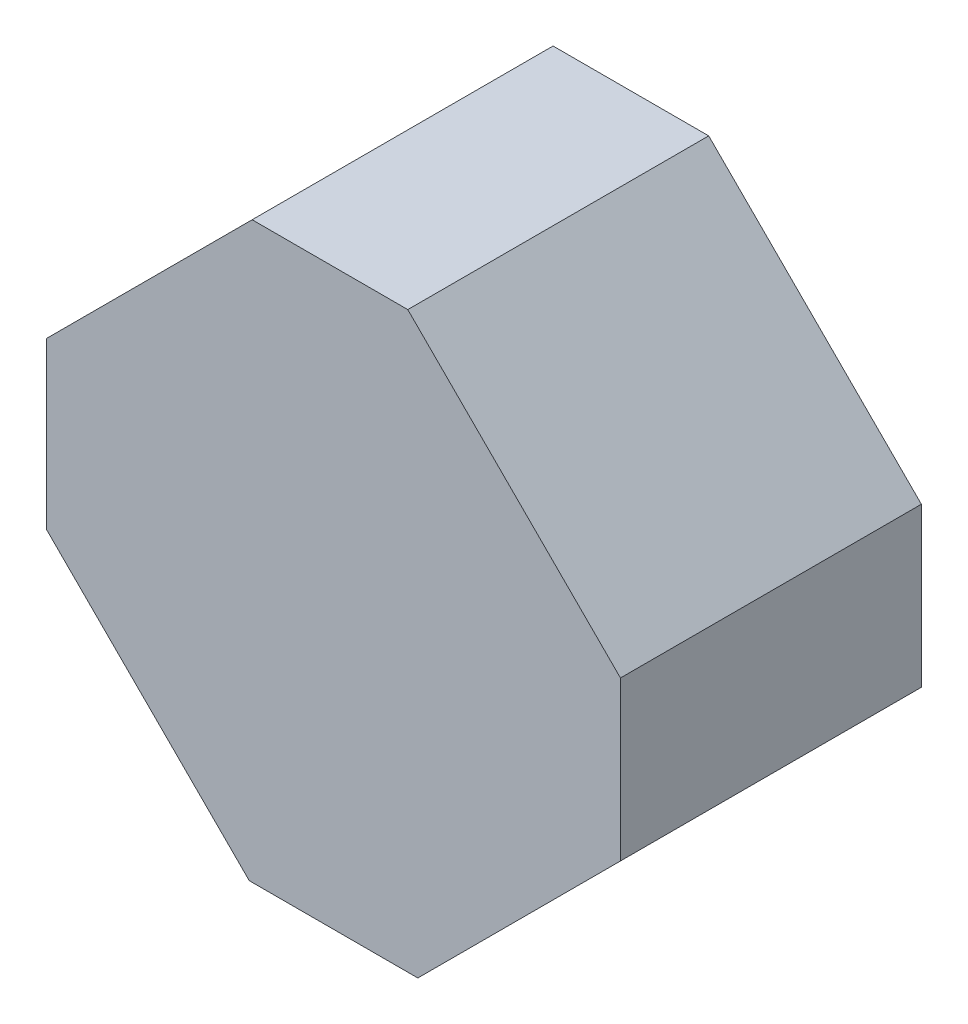
ISO-10303-21;
HEADER;
FILE_DESCRIPTION(('STEP AP214'),'2;1');
FILE_NAME('part.step','',(''),(''),'','','');
FILE_SCHEMA(('AUTOMOTIVE_DESIGN { 1 0 10303 214 1 1 1 1 }'));
ENDSEC;
DATA;
#1=APPLICATION_CONTEXT('core data for automotive mechanical design processes');
#2=APPLICATION_PROTOCOL_DEFINITION('international standard','automotive_design',2000,#1);
#3=PRODUCT_CONTEXT('',#1,'mechanical');
#4=PRODUCT('Part','Part','',(#3));
#5=PRODUCT_RELATED_PRODUCT_CATEGORY('part','',(#4));
#6=PRODUCT_DEFINITION_FORMATION('','',#4);
#7=PRODUCT_DEFINITION_CONTEXT('part definition',#1,'design');
#8=PRODUCT_DEFINITION('design','',#6,#7);
#9=PRODUCT_DEFINITION_SHAPE('','',#8);
#10=(LENGTH_UNIT() NAMED_UNIT(*) SI_UNIT(.MILLI.,.METRE.));
#11=(NAMED_UNIT(*) PLANE_ANGLE_UNIT() SI_UNIT($,.RADIAN.));
#12=(NAMED_UNIT(*) SI_UNIT($,.STERADIAN.) SOLID_ANGLE_UNIT());
#13=UNCERTAINTY_MEASURE_WITH_UNIT(LENGTH_MEASURE(1.E-05),#10,'distance_accuracy_value','');
#14=(GEOMETRIC_REPRESENTATION_CONTEXT(3) GLOBAL_UNCERTAINTY_ASSIGNED_CONTEXT((#13)) GLOBAL_UNIT_ASSIGNED_CONTEXT((#10,
#11,#12)) REPRESENTATION_CONTEXT('',''));
#15=CARTESIAN_POINT('',(0.,0.,0.));
#16=DIRECTION('',(0.,0.,1.));
#17=DIRECTION('',(1.,0.,0.));
#18=AXIS2_PLACEMENT_3D('',#15,#16,#17);
#19=CARTESIAN_POINT('',(-2.86050736,-0.8402066,0.));
#20=DIRECTION('',(-1.,0.,0.));
#21=DIRECTION('',(0.,0.,1.));
#22=AXIS2_PLACEMENT_3D('',#19,#20,#21);
#23=PLANE('',#22);
#24=DIRECTION('',(0.,0.,1.));
#25=VECTOR('',#24,1.);
#26=CARTESIAN_POINT('',(-2.86050736,0.81148174,0.));
#27=LINE('',#26,#25);
#28=CARTESIAN_POINT('',(-2.86050736,0.81148174,0.));
#29=VERTEX_POINT('',#28);
#30=CARTESIAN_POINT('',(-2.86050736,0.81148174,2.99999908));
#31=VERTEX_POINT('',#30);
#32=EDGE_CURVE('E129',#29,#31,#27,.T.);
#33=ORIENTED_EDGE('',*,*,#32,.F.);
#34=DIRECTION('',(0.,1.,0.));
#35=VECTOR('',#34,1.);
#36=CARTESIAN_POINT('',(-2.86050736,-0.8402066,0.));
#37=LINE('',#36,#35);
#38=CARTESIAN_POINT('',(-2.86050736,-0.840209140151087,0.));
#39=VERTEX_POINT('',#38);
#40=EDGE_CURVE('E85',#29,#39,#37,.F.);
#41=ORIENTED_EDGE('',*,*,#40,.T.);
#42=DIRECTION('',(0.,0.,-1.));
#43=VECTOR('',#42,1.);
#44=CARTESIAN_POINT('',(-2.86050736,-0.840209140151087,0.));
#45=LINE('',#44,#43);
#46=CARTESIAN_POINT('',(-2.86050736,-0.840209140151087,2.99999908));
#47=VERTEX_POINT('',#46);
#48=EDGE_CURVE('E134',#47,#39,#45,.T.);
#49=ORIENTED_EDGE('',*,*,#48,.F.);
#50=DIRECTION('',(0.,1.,0.));
#51=VECTOR('',#50,1.);
#52=CARTESIAN_POINT('',(-2.86050736,-0.01802813100038,2.99999908));
#53=LINE('',#52,#51);
#54=EDGE_CURVE('E67',#47,#31,#53,.T.);
#55=ORIENTED_EDGE('',*,*,#54,.T.);
#56=EDGE_LOOP('',(#33,#41,#49,#55));
#57=FACE_BOUND('',#56,.T.);
#58=ADVANCED_FACE('F16',(#57),#23,.T.);
#59=CARTESIAN_POINT('',(-0.81148174,2.86050736,0.));
#60=DIRECTION('',(0.,1.,0.));
#61=DIRECTION('',(0.,0.,1.));
#62=AXIS2_PLACEMENT_3D('',#59,#60,#61);
#63=PLANE('',#62);
#64=DIRECTION('',(0.,0.,1.));
#65=VECTOR('',#64,1.);
#66=CARTESIAN_POINT('',(0.74020934,2.86050736,0.));
#67=LINE('',#66,#65);
#68=CARTESIAN_POINT('',(0.74020934,2.86050736,0.));
#69=VERTEX_POINT('',#68);
#70=CARTESIAN_POINT('',(0.74020934,2.86050736,2.99999908));
#71=VERTEX_POINT('',#70);
#72=EDGE_CURVE('E118',#69,#71,#67,.T.);
#73=ORIENTED_EDGE('',*,*,#72,.F.);
#74=DIRECTION('',(1.,0.,0.));
#75=VECTOR('',#74,1.);
#76=CARTESIAN_POINT('',(-0.81148174,2.86050736,0.));
#77=LINE('',#76,#75);
#78=CARTESIAN_POINT('',(-0.81148174,2.86050736,0.));
#79=VERTEX_POINT('',#78);
#80=EDGE_CURVE('E156',#69,#79,#77,.F.);
#81=ORIENTED_EDGE('',*,*,#80,.T.);
#82=DIRECTION('',(0.,0.,-1.));
#83=VECTOR('',#82,1.);
#84=CARTESIAN_POINT('',(-0.81148174,2.86050736,0.));
#85=LINE('',#84,#83);
#86=CARTESIAN_POINT('',(-0.81148174,2.86050736,2.99999908));
#87=VERTEX_POINT('',#86);
#88=EDGE_CURVE('E123',#87,#79,#85,.T.);
#89=ORIENTED_EDGE('',*,*,#88,.F.);
#90=DIRECTION('',(-1.,0.,0.));
#91=VECTOR('',#90,1.);
#92=CARTESIAN_POINT('',(-0.01001433610169,2.86050736,2.99999908));
#93=LINE('',#92,#91);
#94=EDGE_CURVE('E147',#87,#71,#93,.F.);
#95=ORIENTED_EDGE('',*,*,#94,.T.);
#96=EDGE_LOOP('',(#73,#81,#89,#95));
#97=FACE_BOUND('',#96,.T.);
#98=ADVANCED_FACE('F189',(#97),#63,.T.);
#99=CARTESIAN_POINT('',(2.86050736,0.74020934,0.));
#100=DIRECTION('',(1.,0.,0.));
#101=DIRECTION('',(0.,0.,-1.));
#102=AXIS2_PLACEMENT_3D('',#99,#100,#101);
#103=PLANE('',#102);
#104=DIRECTION('',(0.,0.,1.));
#105=VECTOR('',#104,1.);
#106=CARTESIAN_POINT('',(2.86050736,-0.8402066,0.));
#107=LINE('',#106,#105);
#108=CARTESIAN_POINT('',(2.86050736,-0.8402066,0.));
#109=VERTEX_POINT('',#108);
#110=CARTESIAN_POINT('',(2.86050736,-0.8402066,2.99999908));
#111=VERTEX_POINT('',#110);
#112=EDGE_CURVE('E107',#109,#111,#107,.T.);
#113=ORIENTED_EDGE('',*,*,#112,.F.);
#114=DIRECTION('',(0.,1.,0.));
#115=VECTOR('',#114,1.);
#116=CARTESIAN_POINT('',(2.86050736,0.74020934,0.));
#117=LINE('',#116,#115);
#118=CARTESIAN_POINT('',(2.86050736,0.740206799851236,0.));
#119=VERTEX_POINT('',#118);
#120=EDGE_CURVE('E152',#109,#119,#117,.T.);
#121=ORIENTED_EDGE('',*,*,#120,.T.);
#122=DIRECTION('',(0.,0.,-1.));
#123=VECTOR('',#122,1.);
#124=CARTESIAN_POINT('',(2.86050736,0.740206799851236,0.));
#125=LINE('',#124,#123);
#126=CARTESIAN_POINT('',(2.86050736,0.740206799851236,2.99999908));
#127=VERTEX_POINT('',#126);
#128=EDGE_CURVE('E109',#127,#119,#125,.T.);
#129=ORIENTED_EDGE('',*,*,#128,.F.);
#130=DIRECTION('',(0.,1.,0.));
#131=VECTOR('',#130,1.);
#132=CARTESIAN_POINT('',(2.86050736,-0.01802813100038,2.99999908));
#133=LINE('',#132,#131);
#134=EDGE_CURVE('E97',#127,#111,#133,.F.);
#135=ORIENTED_EDGE('',*,*,#134,.T.);
#136=EDGE_LOOP('',(#113,#121,#129,#135));
#137=FACE_BOUND('',#136,.T.);
#138=ADVANCED_FACE('F186',(#137),#103,.T.);
#139=CARTESIAN_POINT('',(-0.01001433610169,-0.01802813100038,2.99999908));
#140=DIRECTION('',(0.,0.,-1.));
#141=DIRECTION('',(-1.,0.,0.));
#142=AXIS2_PLACEMENT_3D('',#139,#140,#141);
#143=PLANE('',#142);
#144=DIRECTION('',(0.707106781186548,0.707106781186548,0.));
#145=VECTOR('',#144,1.);
#146=CARTESIAN_POINT('',(2.86032956,-0.8403844,2.99999908));
#147=LINE('',#146,#145);
#148=CARTESIAN_POINT('',(0.8402066,-2.86050736,2.99999908));
#149=VERTEX_POINT('',#148);
#150=EDGE_CURVE('E92',#111,#149,#147,.F.);
#151=ORIENTED_EDGE('',*,*,#150,.F.);
#152=ORIENTED_EDGE('',*,*,#134,.F.);
#153=DIRECTION('',(-0.707106357624421,0.707107204748421,0.));
#154=VECTOR('',#153,1.);
#155=CARTESIAN_POINT('',(0.74020934,2.86050736,2.99999908));
#156=LINE('',#155,#154);
#157=EDGE_CURVE('E115',#71,#127,#156,.F.);
#158=ORIENTED_EDGE('',*,*,#157,.F.);
#159=ORIENTED_EDGE('',*,*,#94,.F.);
#160=DIRECTION('',(-0.707106781186548,-0.707106781186548,0.));
#161=VECTOR('',#160,1.);
#162=CARTESIAN_POINT('',(-2.86050736,0.81148174,2.99999908));
#163=LINE('',#162,#161);
#164=EDGE_CURVE('E126',#31,#87,#163,.F.);
#165=ORIENTED_EDGE('',*,*,#164,.F.);
#166=ORIENTED_EDGE('',*,*,#54,.F.);
#167=DIRECTION('',(0.707107225740908,-0.707106336631908,0.));
#168=VECTOR('',#167,1.);
#169=CARTESIAN_POINT('',(-0.84032852,-2.86038544,2.99999908));
#170=LINE('',#169,#168);
#171=CARTESIAN_POINT('',(-0.84016342,-2.8604464,2.99999908));
#172=VERTEX_POINT('',#171);
#173=EDGE_CURVE('E95',#172,#47,#170,.F.);
#174=ORIENTED_EDGE('',*,*,#173,.F.);
#175=DIRECTION('',(1.,0.,0.));
#176=VECTOR('',#175,1.);
#177=CARTESIAN_POINT('',(0.8402066,-2.86050736,2.99999908));
#178=LINE('',#177,#176);
#179=EDGE_CURVE('E73',#149,#172,#178,.F.);
#180=ORIENTED_EDGE('',*,*,#179,.F.);
#181=EDGE_LOOP('',(#151,#152,#158,#159,#165,#166,#174,#180));
#182=FACE_BOUND('',#181,.T.);
#183=ADVANCED_FACE('F90',(#182),#143,.F.);
#184=CARTESIAN_POINT('',(0.8402066,-2.86050736,0.));
#185=DIRECTION('',(0.,-1.,0.));
#186=DIRECTION('',(0.,0.,-1.));
#187=AXIS2_PLACEMENT_3D('',#184,#185,#186);
#188=PLANE('',#187);
#189=DIRECTION('',(0.,0.,1.));
#190=VECTOR('',#189,1.);
#191=CARTESIAN_POINT('',(-0.840206599846699,-2.86050736,0.));
#192=LINE('',#191,#190);
#193=CARTESIAN_POINT('',(-0.84016342,-2.8604464,0.));
#194=VERTEX_POINT('',#193);
#195=EDGE_CURVE('E138',#194,#172,#192,.T.);
#196=ORIENTED_EDGE('',*,*,#195,.F.);
#197=DIRECTION('',(1.,0.,0.));
#198=VECTOR('',#197,1.);
#199=CARTESIAN_POINT('',(0.8402066,-2.86050736,0.));
#200=LINE('',#199,#198);
#201=CARTESIAN_POINT('',(0.8402066,-2.86050736,0.));
#202=VERTEX_POINT('',#201);
#203=EDGE_CURVE('E34',#194,#202,#200,.T.);
#204=ORIENTED_EDGE('',*,*,#203,.T.);
#205=DIRECTION('',(0.,0.,-1.));
#206=VECTOR('',#205,1.);
#207=CARTESIAN_POINT('',(0.8402066,-2.86050736,0.));
#208=LINE('',#207,#206);
#209=EDGE_CURVE('E99',#149,#202,#208,.T.);
#210=ORIENTED_EDGE('',*,*,#209,.F.);
#211=ORIENTED_EDGE('',*,*,#179,.T.);
#212=EDGE_LOOP('',(#196,#204,#210,#211));
#213=FACE_BOUND('',#212,.T.);
#214=ADVANCED_FACE('F100',(#213),#188,.T.);
#215=CARTESIAN_POINT('',(-0.84032852,-2.86038544,0.));
#216=DIRECTION('',(-0.707106336631908,-0.707107225740908,0.));
#217=DIRECTION('',(0.707107225740908,-0.707106336631908,0.));
#218=AXIS2_PLACEMENT_3D('',#215,#216,#217);
#219=PLANE('',#218);
#220=ORIENTED_EDGE('',*,*,#48,.T.);
#221=DIRECTION('',(-0.707107225747083,0.707106336625732,0.));
#222=VECTOR('',#221,1.);
#223=CARTESIAN_POINT('',(-0.84032852,-2.86038544,0.));
#224=LINE('',#223,#222);
#225=EDGE_CURVE('E103',#194,#39,#224,.T.);
#226=ORIENTED_EDGE('',*,*,#225,.F.);
#227=ORIENTED_EDGE('',*,*,#195,.T.);
#228=ORIENTED_EDGE('',*,*,#173,.T.);
#229=EDGE_LOOP('',(#220,#226,#227,#228));
#230=FACE_BOUND('',#229,.T.);
#231=ADVANCED_FACE('F169',(#230),#219,.T.);
#232=CARTESIAN_POINT('',(-2.86050736,0.81148174,0.));
#233=DIRECTION('',(-0.707106781186548,0.707106781186548,0.));
#234=DIRECTION('',(-0.707106781186548,-0.707106781186548,0.));
#235=AXIS2_PLACEMENT_3D('',#232,#233,#234);
#236=PLANE('',#235);
#237=ORIENTED_EDGE('',*,*,#88,.T.);
#238=DIRECTION('',(0.707106781186548,0.707106781186547,0.));
#239=VECTOR('',#238,1.);
#240=CARTESIAN_POINT('',(-2.86050736,0.81148174,0.));
#241=LINE('',#240,#239);
#242=EDGE_CURVE('E170',#29,#79,#241,.T.);
#243=ORIENTED_EDGE('',*,*,#242,.F.);
#244=ORIENTED_EDGE('',*,*,#32,.T.);
#245=ORIENTED_EDGE('',*,*,#164,.T.);
#246=EDGE_LOOP('',(#237,#243,#244,#245));
#247=FACE_BOUND('',#246,.T.);
#248=ADVANCED_FACE('F192',(#247),#236,.T.);
#249=CARTESIAN_POINT('',(0.74020934,2.86050736,0.));
#250=DIRECTION('',(0.707107204748421,0.707106357624421,0.));
#251=DIRECTION('',(-0.707106357624421,0.707107204748421,0.));
#252=AXIS2_PLACEMENT_3D('',#249,#250,#251);
#253=PLANE('',#252);
#254=ORIENTED_EDGE('',*,*,#128,.T.);
#255=DIRECTION('',(0.707106357619044,-0.707107204753798,0.));
#256=VECTOR('',#255,1.);
#257=CARTESIAN_POINT('',(0.74020934,2.86050736,0.));
#258=LINE('',#257,#256);
#259=EDGE_CURVE('E25',#69,#119,#258,.T.);
#260=ORIENTED_EDGE('',*,*,#259,.F.);
#261=ORIENTED_EDGE('',*,*,#72,.T.);
#262=ORIENTED_EDGE('',*,*,#157,.T.);
#263=EDGE_LOOP('',(#254,#260,#261,#262));
#264=FACE_BOUND('',#263,.T.);
#265=ADVANCED_FACE('F182',(#264),#253,.T.);
#266=CARTESIAN_POINT('',(2.86032956,-0.8403844,0.));
#267=DIRECTION('',(0.707106781186548,-0.707106781186548,0.));
#268=DIRECTION('',(0.707106781186548,0.707106781186548,0.));
#269=AXIS2_PLACEMENT_3D('',#266,#267,#268);
#270=PLANE('',#269);
#271=ORIENTED_EDGE('',*,*,#209,.T.);
#272=DIRECTION('',(-0.707106781186547,-0.707106781186547,0.));
#273=VECTOR('',#272,1.);
#274=CARTESIAN_POINT('',(2.86032956,-0.8403844,0.));
#275=LINE('',#274,#273);
#276=EDGE_CURVE('E10',#109,#202,#275,.T.);
#277=ORIENTED_EDGE('',*,*,#276,.F.);
#278=ORIENTED_EDGE('',*,*,#112,.T.);
#279=ORIENTED_EDGE('',*,*,#150,.T.);
#280=EDGE_LOOP('',(#271,#277,#278,#279));
#281=FACE_BOUND('',#280,.T.);
#282=ADVANCED_FACE('F105',(#281),#270,.T.);
#283=CARTESIAN_POINT('',(-0.01001433610169,-0.01802813100038,0.));
#284=DIRECTION('',(0.,0.,-1.));
#285=DIRECTION('',(-1.,0.,0.));
#286=AXIS2_PLACEMENT_3D('',#283,#284,#285);
#287=PLANE('',#286);
#288=ORIENTED_EDGE('',*,*,#276,.T.);
#289=ORIENTED_EDGE('',*,*,#203,.F.);
#290=ORIENTED_EDGE('',*,*,#225,.T.);
#291=ORIENTED_EDGE('',*,*,#40,.F.);
#292=ORIENTED_EDGE('',*,*,#242,.T.);
#293=ORIENTED_EDGE('',*,*,#80,.F.);
#294=ORIENTED_EDGE('',*,*,#259,.T.);
#295=ORIENTED_EDGE('',*,*,#120,.F.);
#296=EDGE_LOOP('',(#288,#289,#290,#291,#292,#293,#294,#295));
#297=FACE_BOUND('',#296,.T.);
#298=ADVANCED_FACE('F179',(#297),#287,.T.);
#299=CLOSED_SHELL('',(#58,#98,#138,#183,#214,#231,#248,#265,#282,#298));
#300=MANIFOLD_SOLID_BREP('B1',#299);
#301=ADVANCED_BREP_SHAPE_REPRESENTATION('',(#18,#300),#14);
#302=SHAPE_DEFINITION_REPRESENTATION(#9,#301);
ENDSEC;
END-ISO-10303-21;
